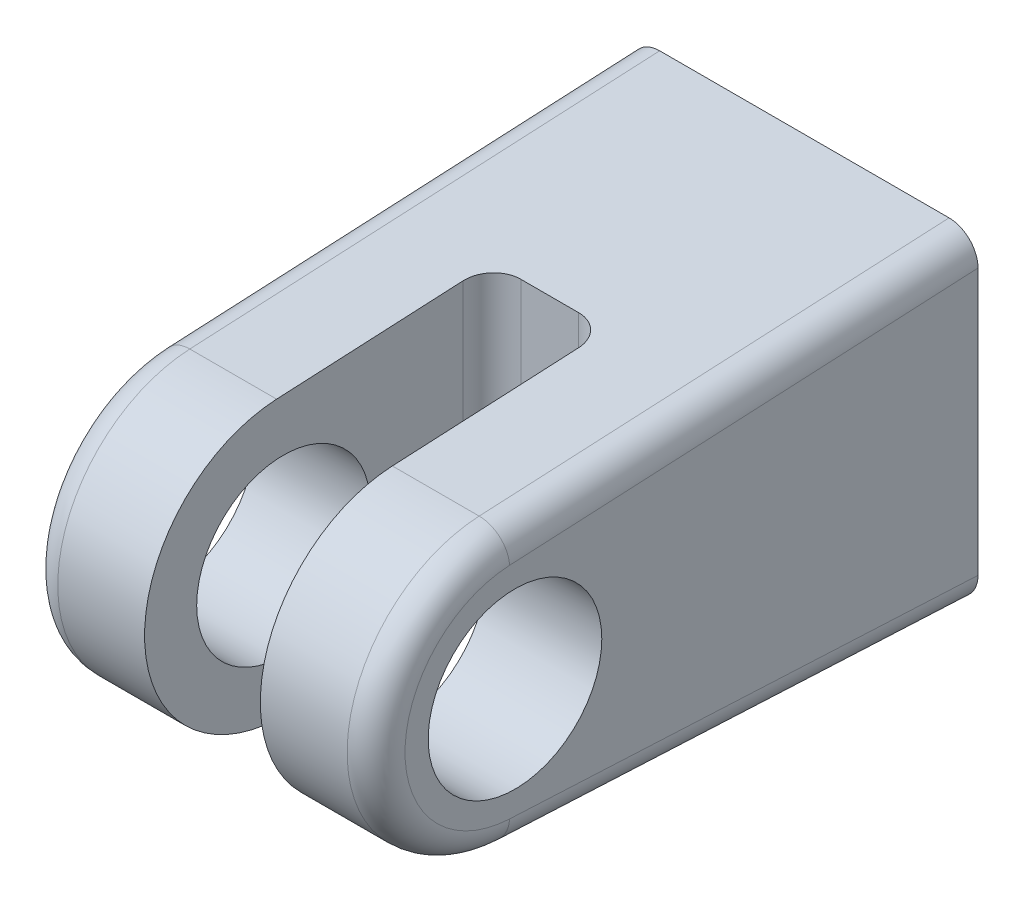
ISO-10303-21;
HEADER;
FILE_DESCRIPTION(('STEP AP214'),'2;1');
FILE_NAME('part.step','',(''),(''),'','','');
FILE_SCHEMA(('AUTOMOTIVE_DESIGN { 1 0 10303 214 1 1 1 1 }'));
ENDSEC;
DATA;
#1=APPLICATION_CONTEXT('core data for automotive mechanical design processes');
#2=APPLICATION_PROTOCOL_DEFINITION('international standard','automotive_design',2000,#1);
#3=PRODUCT_CONTEXT('',#1,'mechanical');
#4=PRODUCT('Part','Part','',(#3));
#5=PRODUCT_RELATED_PRODUCT_CATEGORY('part','',(#4));
#6=PRODUCT_DEFINITION_FORMATION('','',#4);
#7=PRODUCT_DEFINITION_CONTEXT('part definition',#1,'design');
#8=PRODUCT_DEFINITION('design','',#6,#7);
#9=PRODUCT_DEFINITION_SHAPE('','',#8);
#10=(LENGTH_UNIT() NAMED_UNIT(*) SI_UNIT(.MILLI.,.METRE.));
#11=(NAMED_UNIT(*) PLANE_ANGLE_UNIT() SI_UNIT($,.RADIAN.));
#12=(NAMED_UNIT(*) SI_UNIT($,.STERADIAN.) SOLID_ANGLE_UNIT());
#13=UNCERTAINTY_MEASURE_WITH_UNIT(LENGTH_MEASURE(1.E-05),#10,'distance_accuracy_value','');
#14=(GEOMETRIC_REPRESENTATION_CONTEXT(3) GLOBAL_UNCERTAINTY_ASSIGNED_CONTEXT((#13)) GLOBAL_UNIT_ASSIGNED_CONTEXT((#10,
#11,#12)) REPRESENTATION_CONTEXT('',''));
#15=CARTESIAN_POINT('',(0.,0.,0.));
#16=DIRECTION('',(0.,0.,1.));
#17=DIRECTION('',(1.,0.,0.));
#18=AXIS2_PLACEMENT_3D('',#15,#16,#17);
#19=CARTESIAN_POINT('',(9.525,0.,25.4));
#20=DIRECTION('',(-1.,0.,0.));
#21=DIRECTION('',(0.,0.,1.));
#22=AXIS2_PLACEMENT_3D('',#19,#20,#21);
#23=CYLINDRICAL_SURFACE('',#22,7.62);
#24=DIRECTION('',(-1.,0.,0.));
#25=VECTOR('',#24,1.);
#26=CARTESIAN_POINT('',(9.525,-7.61063246853942,25.7777213639888));
#27=LINE('',#26,#25);
#28=CARTESIAN_POINT('',(7.9375,-7.61063246853942,25.7777213639888));
#29=VERTEX_POINT('',#28);
#30=CARTESIAN_POINT('',(3.175,-7.61063246853942,25.7777213639888));
#31=VERTEX_POINT('',#30);
#32=EDGE_CURVE('E150',#29,#31,#27,.T.);
#33=ORIENTED_EDGE('',*,*,#32,.F.);
#34=CARTESIAN_POINT('',(7.9375,0.,25.4));
#35=DIRECTION('',(1.,0.,0.));
#36=DIRECTION('',(0.,0.,-1.));
#37=AXIS2_PLACEMENT_3D('',#34,#35,#36);
#38=CIRCLE('',#37,7.62);
#39=CARTESIAN_POINT('',(7.9375,7.61063246853942,25.7777213639888));
#40=VERTEX_POINT('',#39);
#41=EDGE_CURVE('E218',#29,#40,#38,.F.);
#42=ORIENTED_EDGE('',*,*,#41,.T.);
#43=DIRECTION('',(-1.,0.,0.));
#44=VECTOR('',#43,1.);
#45=CARTESIAN_POINT('',(9.525,7.61063246853942,25.7777213639888));
#46=LINE('',#45,#44);
#47=CARTESIAN_POINT('',(3.175,7.61063246853942,25.7777213639888));
#48=VERTEX_POINT('',#47);
#49=EDGE_CURVE('E169',#40,#48,#46,.T.);
#50=ORIENTED_EDGE('',*,*,#49,.T.);
#51=CARTESIAN_POINT('',(3.175,0.,25.4));
#52=DIRECTION('',(1.,0.,0.));
#53=DIRECTION('',(0.,0.,-1.));
#54=AXIS2_PLACEMENT_3D('',#51,#52,#53);
#55=CIRCLE('',#54,7.62);
#56=EDGE_CURVE('E167',#48,#31,#55,.T.);
#57=ORIENTED_EDGE('',*,*,#56,.T.);
#58=EDGE_LOOP('',(#33,#42,#50,#57));
#59=FACE_BOUND('',#58,.T.);
#60=ADVANCED_FACE('F49',(#59),#23,.T.);
#61=CARTESIAN_POINT('',(9.525,8.89,0.));
#62=DIRECTION('',(0.,0.,1.));
#63=DIRECTION('',(0.,-1.,0.));
#64=AXIS2_PLACEMENT_3D('',#61,#62,#63);
#65=PLANE('',#64);
#66=CARTESIAN_POINT('',(0.,0.,0.));
#67=DIRECTION('',(0.,0.,-1.));
#68=DIRECTION('',(0.,1.,0.));
#69=AXIS2_PLACEMENT_3D('',#66,#67,#68);
#70=CIRCLE('',#69,6.35);
#71=CARTESIAN_POINT('',(0.,6.35,0.));
#72=VERTEX_POINT('',#71);
#73=EDGE_CURVE('E242',#72,#72,#70,.T.);
#74=ORIENTED_EDGE('',*,*,#73,.F.);
#75=EDGE_LOOP('',(#74));
#76=FACE_BOUND('',#75,.T.);
#77=DIRECTION('',(-1.,0.,0.));
#78=VECTOR('',#77,1.);
#79=CARTESIAN_POINT('',(9.525,-8.89,0.));
#80=LINE('',#79,#78);
#81=CARTESIAN_POINT('',(7.9375,-8.89,0.));
#82=VERTEX_POINT('',#81);
#83=CARTESIAN_POINT('',(-7.93749999999999,-8.89,0.));
#84=VERTEX_POINT('',#83);
#85=EDGE_CURVE('E285',#82,#84,#80,.T.);
#86=ORIENTED_EDGE('',*,*,#85,.T.);
#87=CARTESIAN_POINT('',(-7.9375,-7.30054602886092,0.));
#88=DIRECTION('',(0.,0.,1.));
#89=DIRECTION('',(0.,-1.,0.));
#90=AXIS2_PLACEMENT_3D('',#87,#88,#89);
#91=ELLIPSE('',#90,1.58945397113908,1.5875);
#92=CARTESIAN_POINT('',(-9.525,-7.30054602886092,0.));
#93=VERTEX_POINT('',#92);
#94=EDGE_CURVE('E201',#84,#93,#91,.F.);
#95=ORIENTED_EDGE('',*,*,#94,.T.);
#96=DIRECTION('',(0.,1.,0.));
#97=VECTOR('',#96,1.);
#98=CARTESIAN_POINT('',(-9.525,8.89,0.));
#99=LINE('',#98,#97);
#100=CARTESIAN_POINT('',(-9.525,7.30054602886092,0.));
#101=VERTEX_POINT('',#100);
#102=EDGE_CURVE('E269',#93,#101,#99,.T.);
#103=ORIENTED_EDGE('',*,*,#102,.T.);
#104=CARTESIAN_POINT('',(-7.9375,7.30054602886092,0.));
#105=DIRECTION('',(0.,0.,1.));
#106=DIRECTION('',(0.,-1.,0.));
#107=AXIS2_PLACEMENT_3D('',#104,#105,#106);
#108=ELLIPSE('',#107,1.58945397113908,1.5875);
#109=CARTESIAN_POINT('',(-7.93749999999999,8.89,0.));
#110=VERTEX_POINT('',#109);
#111=EDGE_CURVE('E197',#101,#110,#108,.F.);
#112=ORIENTED_EDGE('',*,*,#111,.T.);
#113=DIRECTION('',(-1.,0.,0.));
#114=VECTOR('',#113,1.);
#115=CARTESIAN_POINT('',(9.525,8.89,0.));
#116=LINE('',#115,#114);
#117=CARTESIAN_POINT('',(7.9375,8.89,0.));
#118=VERTEX_POINT('',#117);
#119=EDGE_CURVE('E177',#118,#110,#116,.T.);
#120=ORIENTED_EDGE('',*,*,#119,.F.);
#121=CARTESIAN_POINT('',(7.9375,7.30054602886092,0.));
#122=DIRECTION('',(0.,0.,1.));
#123=DIRECTION('',(0.,1.,0.));
#124=AXIS2_PLACEMENT_3D('',#121,#122,#123);
#125=ELLIPSE('',#124,1.58945397113908,1.5875);
#126=CARTESIAN_POINT('',(9.525,7.30054602886092,0.));
#127=VERTEX_POINT('',#126);
#128=EDGE_CURVE('E195',#118,#127,#125,.F.);
#129=ORIENTED_EDGE('',*,*,#128,.T.);
#130=DIRECTION('',(0.,1.,0.));
#131=VECTOR('',#130,1.);
#132=CARTESIAN_POINT('',(9.525,8.89,0.));
#133=LINE('',#132,#131);
#134=CARTESIAN_POINT('',(9.525,-7.30054602886092,0.));
#135=VERTEX_POINT('',#134);
#136=EDGE_CURVE('E287',#135,#127,#133,.T.);
#137=ORIENTED_EDGE('',*,*,#136,.F.);
#138=CARTESIAN_POINT('',(7.9375,-7.30054602886092,0.));
#139=DIRECTION('',(0.,0.,1.));
#140=DIRECTION('',(0.,1.,0.));
#141=AXIS2_PLACEMENT_3D('',#138,#139,#140);
#142=ELLIPSE('',#141,1.58945397113908,1.5875);
#143=EDGE_CURVE('E199',#135,#82,#142,.F.);
#144=ORIENTED_EDGE('',*,*,#143,.T.);
#145=EDGE_LOOP('',(#86,#95,#103,#112,#120,#129,#137,#144));
#146=FACE_BOUND('',#145,.T.);
#147=ADVANCED_FACE('F263',(#76,#146),#65,.F.);
#148=CARTESIAN_POINT('',(9.525,8.89,0.));
#149=DIRECTION('',(0.,-0.998770665162654,-0.0495697328069288));
#150=DIRECTION('',(0.,0.0495697328069289,-0.998770665162654));
#151=AXIS2_PLACEMENT_3D('',#148,#149,#150);
#152=PLANE('',#151);
#153=ORIENTED_EDGE('',*,*,#119,.T.);
#154=DIRECTION('',(0.,-0.0495697328069289,0.998770665162654));
#155=VECTOR('',#154,1.);
#156=CARTESIAN_POINT('',(-7.9375,8.89,0.));
#157=LINE('',#156,#155);
#158=CARTESIAN_POINT('',(-7.93749999999999,7.61063246853942,25.7777213639888));
#159=VERTEX_POINT('',#158);
#160=EDGE_CURVE('E230',#110,#159,#157,.T.);
#161=ORIENTED_EDGE('',*,*,#160,.T.);
#162=CARTESIAN_POINT('',(-3.175,7.61063246853942,25.7777213639888));
#163=VERTEX_POINT('',#162);
#164=EDGE_CURVE('E162',#163,#159,#46,.T.);
#165=ORIENTED_EDGE('',*,*,#164,.F.);
#166=DIRECTION('',(0.,0.0495697328069289,-0.998770665162654));
#167=VECTOR('',#166,1.);
#168=CARTESIAN_POINT('',(-3.17500000000001,8.89,0.));
#169=LINE('',#168,#167);
#170=CARTESIAN_POINT('',(-3.175,8.11786967514889,15.5575));
#171=VERTEX_POINT('',#170);
#172=EDGE_CURVE('E289',#163,#171,#169,.T.);
#173=ORIENTED_EDGE('',*,*,#172,.T.);
#174=CARTESIAN_POINT('',(-1.5875,8.11786967514889,15.5575));
#175=DIRECTION('',(0.,-0.998770665162654,-0.0495697328069288));
#176=DIRECTION('',(0.,-0.0495697328069289,0.998770665162654));
#177=AXIS2_PLACEMENT_3D('',#174,#175,#176);
#178=ELLIPSE('',#177,1.58945397113908,1.5875);
#179=CARTESIAN_POINT('',(-1.5875,8.19665848380717,13.97));
#180=VERTEX_POINT('',#179);
#181=EDGE_CURVE('E232',#171,#180,#178,.T.);
#182=ORIENTED_EDGE('',*,*,#181,.T.);
#183=DIRECTION('',(1.,0.,0.));
#184=VECTOR('',#183,1.);
#185=CARTESIAN_POINT('',(9.525,8.19665848380717,13.97));
#186=LINE('',#185,#184);
#187=CARTESIAN_POINT('',(1.5875,8.19665848380717,13.97));
#188=VERTEX_POINT('',#187);
#189=EDGE_CURVE('E293',#180,#188,#186,.T.);
#190=ORIENTED_EDGE('',*,*,#189,.T.);
#191=CARTESIAN_POINT('',(1.5875,8.11786967514889,15.5575));
#192=DIRECTION('',(0.,-0.998770665162654,-0.0495697328069288));
#193=DIRECTION('',(0.,-0.0495697328069289,0.998770665162654));
#194=AXIS2_PLACEMENT_3D('',#191,#192,#193);
#195=ELLIPSE('',#194,1.58945397113908,1.5875);
#196=CARTESIAN_POINT('',(3.175,8.11786967514889,15.5575));
#197=VERTEX_POINT('',#196);
#198=EDGE_CURVE('E58',#188,#197,#195,.T.);
#199=ORIENTED_EDGE('',*,*,#198,.T.);
#200=DIRECTION('',(0.,-0.0495697328069289,0.998770665162654));
#201=VECTOR('',#200,1.);
#202=CARTESIAN_POINT('',(3.175,8.89,0.));
#203=LINE('',#202,#201);
#204=EDGE_CURVE('E171',#197,#48,#203,.T.);
#205=ORIENTED_EDGE('',*,*,#204,.T.);
#206=ORIENTED_EDGE('',*,*,#49,.F.);
#207=DIRECTION('',(0.,-0.0495697328069289,0.998770665162654));
#208=VECTOR('',#207,1.);
#209=CARTESIAN_POINT('',(7.9375,8.89,0.));
#210=LINE('',#209,#208);
#211=EDGE_CURVE('E228',#40,#118,#210,.F.);
#212=ORIENTED_EDGE('',*,*,#211,.T.);
#213=EDGE_LOOP('',(#153,#161,#165,#173,#182,#190,#199,#205,#206,#212));
#214=FACE_BOUND('',#213,.T.);
#215=ADVANCED_FACE('F259',(#214),#152,.F.);
#216=ORIENTED_EDGE('',*,*,#164,.T.);
#217=CARTESIAN_POINT('',(-7.9375,0.,25.4));
#218=DIRECTION('',(1.,0.,0.));
#219=DIRECTION('',(0.,0.,-1.));
#220=AXIS2_PLACEMENT_3D('',#217,#218,#219);
#221=CIRCLE('',#220,7.62);
#222=CARTESIAN_POINT('',(-7.93749999999999,-7.61063246853942,25.7777213639888));
#223=VERTEX_POINT('',#222);
#224=EDGE_CURVE('E209',#159,#223,#221,.T.);
#225=ORIENTED_EDGE('',*,*,#224,.T.);
#226=CARTESIAN_POINT('',(-3.175,-7.61063246853942,25.7777213639888));
#227=VERTEX_POINT('',#226);
#228=EDGE_CURVE('E163',#227,#223,#27,.T.);
#229=ORIENTED_EDGE('',*,*,#228,.F.);
#230=CARTESIAN_POINT('',(-3.175,0.,25.4));
#231=DIRECTION('',(-1.,0.,0.));
#232=DIRECTION('',(0.,0.,1.));
#233=AXIS2_PLACEMENT_3D('',#230,#231,#232);
#234=CIRCLE('',#233,7.62);
#235=EDGE_CURVE('E283',#227,#163,#234,.T.);
#236=ORIENTED_EDGE('',*,*,#235,.T.);
#237=EDGE_LOOP('',(#216,#225,#229,#236));
#238=FACE_BOUND('',#237,.T.);
#239=ADVANCED_FACE('F280',(#238),#23,.T.);
#240=CARTESIAN_POINT('',(9.525,-8.89,0.));
#241=DIRECTION('',(0.,0.998770665162654,-0.0495697328069286));
#242=DIRECTION('',(0.,0.0495697328069286,0.998770665162654));
#243=AXIS2_PLACEMENT_3D('',#240,#241,#242);
#244=PLANE('',#243);
#245=ORIENTED_EDGE('',*,*,#228,.T.);
#246=DIRECTION('',(0.,-0.0495697328069286,-0.998770665162654));
#247=VECTOR('',#246,1.);
#248=CARTESIAN_POINT('',(-7.9375,-8.89,0.));
#249=LINE('',#248,#247);
#250=EDGE_CURVE('E192',#223,#84,#249,.T.);
#251=ORIENTED_EDGE('',*,*,#250,.T.);
#252=ORIENTED_EDGE('',*,*,#85,.F.);
#253=DIRECTION('',(0.,-0.0495697328069286,-0.998770665162654));
#254=VECTOR('',#253,1.);
#255=CARTESIAN_POINT('',(7.9375,-7.61063246853942,25.7777213639888));
#256=LINE('',#255,#254);
#257=EDGE_CURVE('E159',#82,#29,#256,.F.);
#258=ORIENTED_EDGE('',*,*,#257,.T.);
#259=ORIENTED_EDGE('',*,*,#32,.T.);
#260=DIRECTION('',(0.,-0.0495697328069286,-0.998770665162654));
#261=VECTOR('',#260,1.);
#262=CARTESIAN_POINT('',(3.175,-8.89,0.));
#263=LINE('',#262,#261);
#264=CARTESIAN_POINT('',(3.175,-8.1178696751489,15.5575));
#265=VERTEX_POINT('',#264);
#266=EDGE_CURVE('E155',#31,#265,#263,.T.);
#267=ORIENTED_EDGE('',*,*,#266,.T.);
#268=CARTESIAN_POINT('',(1.5875,-8.1178696751489,15.5575));
#269=DIRECTION('',(0.,0.998770665162654,-0.0495697328069286));
#270=DIRECTION('',(0.,-0.0495697328069286,-0.998770665162654));
#271=AXIS2_PLACEMENT_3D('',#268,#269,#270);
#272=ELLIPSE('',#271,1.58945397113908,1.5875);
#273=CARTESIAN_POINT('',(1.5875,-8.19665848380717,13.97));
#274=VERTEX_POINT('',#273);
#275=EDGE_CURVE('E13',#265,#274,#272,.T.);
#276=ORIENTED_EDGE('',*,*,#275,.T.);
#277=DIRECTION('',(-1.,0.,0.));
#278=VECTOR('',#277,1.);
#279=CARTESIAN_POINT('',(9.525,-8.19665848380717,13.97));
#280=LINE('',#279,#278);
#281=CARTESIAN_POINT('',(-1.5875,-8.19665848380717,13.97));
#282=VERTEX_POINT('',#281);
#283=EDGE_CURVE('E176',#274,#282,#280,.T.);
#284=ORIENTED_EDGE('',*,*,#283,.T.);
#285=CARTESIAN_POINT('',(-1.5875,-8.1178696751489,15.5575));
#286=DIRECTION('',(0.,0.998770665162654,-0.0495697328069286));
#287=DIRECTION('',(0.,-0.0495697328069286,-0.998770665162654));
#288=AXIS2_PLACEMENT_3D('',#285,#286,#287);
#289=ELLIPSE('',#288,1.58945397113908,1.5875);
#290=CARTESIAN_POINT('',(-3.175,-8.1178696751489,15.5575));
#291=VERTEX_POINT('',#290);
#292=EDGE_CURVE('E234',#282,#291,#289,.T.);
#293=ORIENTED_EDGE('',*,*,#292,.T.);
#294=DIRECTION('',(0.,0.0495697328069286,0.998770665162654));
#295=VECTOR('',#294,1.);
#296=CARTESIAN_POINT('',(-3.17500000000001,-8.89,0.));
#297=LINE('',#296,#295);
#298=EDGE_CURVE('E180',#291,#227,#297,.T.);
#299=ORIENTED_EDGE('',*,*,#298,.T.);
#300=EDGE_LOOP('',(#245,#251,#252,#258,#259,#267,#276,#284,#293,#299));
#301=FACE_BOUND('',#300,.T.);
#302=ADVANCED_FACE('F153',(#301),#244,.F.);
#303=CARTESIAN_POINT('',(9.525,0.,25.4));
#304=DIRECTION('',(1.,0.,0.));
#305=DIRECTION('',(0.,0.,-1.));
#306=AXIS2_PLACEMENT_3D('',#303,#304,#305);
#307=PLANE('',#306);
#308=CARTESIAN_POINT('',(9.525,0.,25.4));
#309=DIRECTION('',(1.,0.,0.));
#310=DIRECTION('',(0.,0.,-1.));
#311=AXIS2_PLACEMENT_3D('',#308,#309,#310);
#312=CIRCLE('',#311,4.7625);
#313=CARTESIAN_POINT('',(9.525,0.,20.6375));
#314=VERTEX_POINT('',#313);
#315=EDGE_CURVE('E298',#314,#314,#312,.T.);
#316=ORIENTED_EDGE('',*,*,#315,.F.);
#317=EDGE_LOOP('',(#316));
#318=FACE_BOUND('',#317,.T.);
#319=CARTESIAN_POINT('',(9.525,0.,25.4));
#320=DIRECTION('',(1.,0.,0.));
#321=DIRECTION('',(0.,0.,-1.));
#322=AXIS2_PLACEMENT_3D('',#319,#320,#321);
#323=CIRCLE('',#322,6.0325);
#324=CARTESIAN_POINT('',(9.525,6.0250840375937,25.6990294131578));
#325=VERTEX_POINT('',#324);
#326=CARTESIAN_POINT('',(9.525,-6.02508403759371,25.6990294131578));
#327=VERTEX_POINT('',#326);
#328=EDGE_CURVE('E213',#325,#327,#323,.T.);
#329=ORIENTED_EDGE('',*,*,#328,.T.);
#330=DIRECTION('',(0.,-0.0495697328069286,-0.998770665162654));
#331=VECTOR('',#330,1.);
#332=CARTESIAN_POINT('',(9.525,-7.30445156905429,-0.0786919508310134));
#333=LINE('',#332,#331);
#334=EDGE_CURVE('E215',#327,#135,#333,.T.);
#335=ORIENTED_EDGE('',*,*,#334,.T.);
#336=ORIENTED_EDGE('',*,*,#136,.T.);
#337=DIRECTION('',(0.,-0.0495697328069289,0.998770665162654));
#338=VECTOR('',#337,1.);
#339=CARTESIAN_POINT('',(9.525,6.0250840375937,25.6990294131578));
#340=LINE('',#339,#338);
#341=EDGE_CURVE('E211',#127,#325,#340,.T.);
#342=ORIENTED_EDGE('',*,*,#341,.T.);
#343=EDGE_LOOP('',(#329,#335,#336,#342));
#344=FACE_BOUND('',#343,.T.);
#345=ADVANCED_FACE('F363',(#318,#344),#307,.T.);
#346=CARTESIAN_POINT('',(-9.525,0.,25.4));
#347=DIRECTION('',(1.,0.,0.));
#348=DIRECTION('',(0.,0.,-1.));
#349=AXIS2_PLACEMENT_3D('',#346,#347,#348);
#350=PLANE('',#349);
#351=CARTESIAN_POINT('',(-9.525,0.,25.4));
#352=DIRECTION('',(1.,0.,0.));
#353=DIRECTION('',(0.,0.,-1.));
#354=AXIS2_PLACEMENT_3D('',#351,#352,#353);
#355=CIRCLE('',#354,4.7625);
#356=CARTESIAN_POINT('',(-9.525,0.,20.6375));
#357=VERTEX_POINT('',#356);
#358=EDGE_CURVE('E190',#357,#357,#355,.T.);
#359=ORIENTED_EDGE('',*,*,#358,.T.);
#360=EDGE_LOOP('',(#359));
#361=FACE_BOUND('',#360,.T.);
#362=ORIENTED_EDGE('',*,*,#102,.F.);
#363=DIRECTION('',(0.,-0.0495697328069286,-0.998770665162654));
#364=VECTOR('',#363,1.);
#365=CARTESIAN_POINT('',(-9.525,-6.02508403759371,25.6990294131578));
#366=LINE('',#365,#364);
#367=CARTESIAN_POINT('',(-9.525,-6.02508403759371,25.6990294131578));
#368=VERTEX_POINT('',#367);
#369=EDGE_CURVE('E207',#93,#368,#366,.F.);
#370=ORIENTED_EDGE('',*,*,#369,.T.);
#371=CARTESIAN_POINT('',(-9.525,0.,25.4));
#372=DIRECTION('',(1.,0.,0.));
#373=DIRECTION('',(0.,0.,-1.));
#374=AXIS2_PLACEMENT_3D('',#371,#372,#373);
#375=CIRCLE('',#374,6.0325);
#376=CARTESIAN_POINT('',(-9.525,6.02508403759371,25.6990294131578));
#377=VERTEX_POINT('',#376);
#378=EDGE_CURVE('E205',#368,#377,#375,.F.);
#379=ORIENTED_EDGE('',*,*,#378,.T.);
#380=DIRECTION('',(0.,-0.0495697328069289,0.998770665162654));
#381=VECTOR('',#380,1.);
#382=CARTESIAN_POINT('',(-9.525,6.0250840375937,25.6990294131578));
#383=LINE('',#382,#381);
#384=EDGE_CURVE('E203',#377,#101,#383,.F.);
#385=ORIENTED_EDGE('',*,*,#384,.T.);
#386=EDGE_LOOP('',(#362,#370,#379,#385));
#387=FACE_BOUND('',#386,.T.);
#388=ADVANCED_FACE('F361',(#361,#387),#350,.F.);
#389=CARTESIAN_POINT('',(-3.175,-8.89,13.97));
#390=DIRECTION('',(-1.,0.,0.));
#391=DIRECTION('',(0.,0.,1.));
#392=AXIS2_PLACEMENT_3D('',#389,#390,#391);
#393=PLANE('',#392);
#394=CARTESIAN_POINT('',(-3.175,0.,25.4));
#395=DIRECTION('',(-1.,0.,0.));
#396=DIRECTION('',(0.,0.,1.));
#397=AXIS2_PLACEMENT_3D('',#394,#395,#396);
#398=CIRCLE('',#397,4.7625);
#399=CARTESIAN_POINT('',(-3.175,0.,30.1625));
#400=VERTEX_POINT('',#399);
#401=EDGE_CURVE('E172',#400,#400,#398,.T.);
#402=ORIENTED_EDGE('',*,*,#401,.T.);
#403=EDGE_LOOP('',(#402));
#404=FACE_BOUND('',#403,.T.);
#405=ORIENTED_EDGE('',*,*,#298,.F.);
#406=DIRECTION('',(0.,1.,0.));
#407=VECTOR('',#406,1.);
#408=CARTESIAN_POINT('',(-3.175,8.19665848380717,15.5575));
#409=LINE('',#408,#407);
#410=EDGE_CURVE('E220',#291,#171,#409,.T.);
#411=ORIENTED_EDGE('',*,*,#410,.T.);
#412=ORIENTED_EDGE('',*,*,#172,.F.);
#413=ORIENTED_EDGE('',*,*,#235,.F.);
#414=EDGE_LOOP('',(#405,#411,#412,#413));
#415=FACE_BOUND('',#414,.T.);
#416=ADVANCED_FACE('F355',(#404,#415),#393,.F.);
#417=CARTESIAN_POINT('',(-3.175,-8.89,13.97));
#418=DIRECTION('',(0.,0.,-1.));
#419=DIRECTION('',(-1.,0.,0.));
#420=AXIS2_PLACEMENT_3D('',#417,#418,#419);
#421=PLANE('',#420);
#422=ORIENTED_EDGE('',*,*,#189,.F.);
#423=DIRECTION('',(0.,1.,0.));
#424=VECTOR('',#423,1.);
#425=CARTESIAN_POINT('',(-1.5875,-8.19665848380717,13.97));
#426=LINE('',#425,#424);
#427=EDGE_CURVE('E225',#180,#282,#426,.F.);
#428=ORIENTED_EDGE('',*,*,#427,.T.);
#429=ORIENTED_EDGE('',*,*,#283,.F.);
#430=DIRECTION('',(0.,1.,0.));
#431=VECTOR('',#430,1.);
#432=CARTESIAN_POINT('',(1.5875,8.19665848380717,13.97));
#433=LINE('',#432,#431);
#434=EDGE_CURVE('E223',#274,#188,#433,.T.);
#435=ORIENTED_EDGE('',*,*,#434,.T.);
#436=EDGE_LOOP('',(#422,#428,#429,#435));
#437=FACE_BOUND('',#436,.T.);
#438=ADVANCED_FACE('F370',(#437),#421,.F.);
#439=CARTESIAN_POINT('',(3.175,-8.89,13.97));
#440=DIRECTION('',(1.,0.,0.));
#441=DIRECTION('',(0.,0.,-1.));
#442=AXIS2_PLACEMENT_3D('',#439,#440,#441);
#443=PLANE('',#442);
#444=CARTESIAN_POINT('',(3.175,0.,25.4));
#445=DIRECTION('',(1.,0.,0.));
#446=DIRECTION('',(0.,0.,-1.));
#447=AXIS2_PLACEMENT_3D('',#444,#445,#446);
#448=CIRCLE('',#447,4.7625);
#449=CARTESIAN_POINT('',(3.175,0.,20.6375));
#450=VERTEX_POINT('',#449);
#451=EDGE_CURVE('E187',#450,#450,#448,.T.);
#452=ORIENTED_EDGE('',*,*,#451,.T.);
#453=EDGE_LOOP('',(#452));
#454=FACE_BOUND('',#453,.T.);
#455=ORIENTED_EDGE('',*,*,#204,.F.);
#456=DIRECTION('',(0.,1.,0.));
#457=VECTOR('',#456,1.);
#458=CARTESIAN_POINT('',(3.175,-8.19665848380717,15.5575));
#459=LINE('',#458,#457);
#460=EDGE_CURVE('E175',#197,#265,#459,.F.);
#461=ORIENTED_EDGE('',*,*,#460,.T.);
#462=ORIENTED_EDGE('',*,*,#266,.F.);
#463=ORIENTED_EDGE('',*,*,#56,.F.);
#464=EDGE_LOOP('',(#455,#461,#462,#463));
#465=FACE_BOUND('',#464,.T.);
#466=ADVANCED_FACE('F174',(#454,#465),#443,.F.);
#467=CARTESIAN_POINT('',(-9.525,0.,25.4));
#468=DIRECTION('',(1.,0.,0.));
#469=DIRECTION('',(0.,0.,-1.));
#470=AXIS2_PLACEMENT_3D('',#467,#468,#469);
#471=CYLINDRICAL_SURFACE('',#470,4.7625);
#472=ORIENTED_EDGE('',*,*,#315,.T.);
#473=EDGE_LOOP('',(#472));
#474=FACE_BOUND('',#473,.T.);
#475=ORIENTED_EDGE('',*,*,#451,.F.);
#476=EDGE_LOOP('',(#475));
#477=FACE_BOUND('',#476,.T.);
#478=ADVANCED_FACE('F419',(#474,#477),#471,.F.);
#479=ORIENTED_EDGE('',*,*,#358,.F.);
#480=EDGE_LOOP('',(#479));
#481=FACE_BOUND('',#480,.T.);
#482=ORIENTED_EDGE('',*,*,#401,.F.);
#483=EDGE_LOOP('',(#482));
#484=FACE_BOUND('',#483,.T.);
#485=ADVANCED_FACE('F314',(#481,#484),#471,.F.);
#486=CARTESIAN_POINT('',(0.,0.,9.525));
#487=DIRECTION('',(0.,0.,-1.));
#488=DIRECTION('',(0.,1.,0.));
#489=AXIS2_PLACEMENT_3D('',#486,#487,#488);
#490=CYLINDRICAL_SURFACE('',#489,6.35);
#491=CARTESIAN_POINT('',(0.,0.,9.525));
#492=DIRECTION('',(0.,0.,-1.));
#493=DIRECTION('',(0.,1.,0.));
#494=AXIS2_PLACEMENT_3D('',#491,#492,#493);
#495=CIRCLE('',#494,6.35);
#496=CARTESIAN_POINT('',(0.,6.35,9.525));
#497=VERTEX_POINT('',#496);
#498=EDGE_CURVE('E301',#497,#497,#495,.T.);
#499=ORIENTED_EDGE('',*,*,#498,.F.);
#500=EDGE_LOOP('',(#499));
#501=FACE_BOUND('',#500,.T.);
#502=ORIENTED_EDGE('',*,*,#73,.T.);
#503=EDGE_LOOP('',(#502));
#504=FACE_BOUND('',#503,.T.);
#505=ADVANCED_FACE('F311',(#501,#504),#490,.F.);
#506=CARTESIAN_POINT('',(0.,0.,9.525));
#507=DIRECTION('',(0.,0.,-1.));
#508=DIRECTION('',(0.,1.,0.));
#509=AXIS2_PLACEMENT_3D('',#506,#507,#508);
#510=PLANE('',#509);
#511=ORIENTED_EDGE('',*,*,#498,.T.);
#512=EDGE_LOOP('',(#511));
#513=FACE_BOUND('',#512,.T.);
#514=ADVANCED_FACE('F309',(#513),#510,.T.);
#515=CARTESIAN_POINT('',(-7.9375,7.30445156905429,-0.0786919508309994));
#516=DIRECTION('',(0.,-0.0495697328069289,0.998770665162654));
#517=DIRECTION('',(0.,-0.998770665162654,-0.0495697328069288));
#518=AXIS2_PLACEMENT_3D('',#515,#516,#517);
#519=CYLINDRICAL_SURFACE('',#518,1.5875);
#520=ORIENTED_EDGE('',*,*,#111,.F.);
#521=ORIENTED_EDGE('',*,*,#384,.F.);
#522=CARTESIAN_POINT('',(-7.9375,6.0250840375937,25.6990294131578));
#523=DIRECTION('',(0.,-0.0495697328069288,0.998770665162654));
#524=DIRECTION('',(0.,-0.998770665162654,-0.0495697328069288));
#525=AXIS2_PLACEMENT_3D('',#522,#523,#524);
#526=CIRCLE('',#525,1.5875);
#527=EDGE_CURVE('E240',#159,#377,#526,.T.);
#528=ORIENTED_EDGE('',*,*,#527,.F.);
#529=ORIENTED_EDGE('',*,*,#160,.F.);
#530=EDGE_LOOP('',(#520,#521,#528,#529));
#531=FACE_BOUND('',#530,.T.);
#532=ADVANCED_FACE('F272',(#531),#519,.T.);
#533=CARTESIAN_POINT('',(-7.9375,0.,25.4));
#534=DIRECTION('',(1.,0.,0.));
#535=DIRECTION('',(0.,0.,-1.));
#536=AXIS2_PLACEMENT_3D('',#533,#534,#535);
#537=TOROIDAL_SURFACE('',#536,6.0325,1.5875);
#538=ORIENTED_EDGE('',*,*,#527,.T.);
#539=ORIENTED_EDGE('',*,*,#378,.F.);
#540=CARTESIAN_POINT('',(-7.9375,-6.02508403759371,25.6990294131578));
#541=DIRECTION('',(0.,-0.0495697328069288,-0.998770665162654));
#542=DIRECTION('',(0.,0.998770665162654,-0.0495697328069288));
#543=AXIS2_PLACEMENT_3D('',#540,#541,#542);
#544=CIRCLE('',#543,1.5875);
#545=EDGE_CURVE('E237',#223,#368,#544,.T.);
#546=ORIENTED_EDGE('',*,*,#545,.F.);
#547=ORIENTED_EDGE('',*,*,#224,.F.);
#548=EDGE_LOOP('',(#538,#539,#546,#547));
#549=FACE_BOUND('',#548,.T.);
#550=ADVANCED_FACE('F330',(#549),#537,.T.);
#551=CARTESIAN_POINT('',(-7.9375,-7.30445156905429,-0.0786919508310012));
#552=DIRECTION('',(0.,-0.0495697328069286,-0.998770665162654));
#553=DIRECTION('',(0.,0.998770665162654,-0.0495697328069286));
#554=AXIS2_PLACEMENT_3D('',#551,#552,#553);
#555=CYLINDRICAL_SURFACE('',#554,1.5875);
#556=ORIENTED_EDGE('',*,*,#545,.T.);
#557=ORIENTED_EDGE('',*,*,#369,.F.);
#558=ORIENTED_EDGE('',*,*,#94,.F.);
#559=ORIENTED_EDGE('',*,*,#250,.F.);
#560=EDGE_LOOP('',(#556,#557,#558,#559));
#561=FACE_BOUND('',#560,.T.);
#562=ADVANCED_FACE('F327',(#561),#555,.T.);
#563=CARTESIAN_POINT('',(7.9375,6.0250840375937,25.6990294131578));
#564=DIRECTION('',(0.,0.0495697328069289,-0.998770665162654));
#565=DIRECTION('',(0.,0.998770665162654,0.0495697328069288));
#566=AXIS2_PLACEMENT_3D('',#563,#564,#565);
#567=CYLINDRICAL_SURFACE('',#566,1.5875);
#568=ORIENTED_EDGE('',*,*,#128,.F.);
#569=ORIENTED_EDGE('',*,*,#211,.F.);
#570=CARTESIAN_POINT('',(7.9375,6.0250840375937,25.6990294131578));
#571=DIRECTION('',(0.,-0.0495697328069288,0.998770665162654));
#572=DIRECTION('',(0.,-0.998770665162654,-0.0495697328069288));
#573=AXIS2_PLACEMENT_3D('',#570,#571,#572);
#574=CIRCLE('',#573,1.5875);
#575=EDGE_CURVE('E53',#325,#40,#574,.T.);
#576=ORIENTED_EDGE('',*,*,#575,.F.);
#577=ORIENTED_EDGE('',*,*,#341,.F.);
#578=EDGE_LOOP('',(#568,#569,#576,#577));
#579=FACE_BOUND('',#578,.T.);
#580=ADVANCED_FACE('F257',(#579),#567,.T.);
#581=CARTESIAN_POINT('',(7.9375,0.,25.4));
#582=DIRECTION('',(1.,0.,0.));
#583=DIRECTION('',(0.,0.,-1.));
#584=AXIS2_PLACEMENT_3D('',#581,#582,#583);
#585=TOROIDAL_SURFACE('',#584,6.0325,1.5875);
#586=ORIENTED_EDGE('',*,*,#575,.T.);
#587=ORIENTED_EDGE('',*,*,#41,.F.);
#588=CARTESIAN_POINT('',(7.9375,-6.02508403759371,25.6990294131578));
#589=DIRECTION('',(0.,-0.0495697328069288,-0.998770665162654));
#590=DIRECTION('',(0.,0.998770665162654,-0.0495697328069288));
#591=AXIS2_PLACEMENT_3D('',#588,#589,#590);
#592=CIRCLE('',#591,1.5875);
#593=EDGE_CURVE('E243',#327,#29,#592,.T.);
#594=ORIENTED_EDGE('',*,*,#593,.F.);
#595=ORIENTED_EDGE('',*,*,#328,.F.);
#596=EDGE_LOOP('',(#586,#587,#594,#595));
#597=FACE_BOUND('',#596,.T.);
#598=ADVANCED_FACE('F252',(#597),#585,.T.);
#599=CARTESIAN_POINT('',(7.9375,-6.02508403759371,25.6990294131578));
#600=DIRECTION('',(0.,0.0495697328069286,0.998770665162654));
#601=DIRECTION('',(0.,-0.998770665162654,0.0495697328069286));
#602=AXIS2_PLACEMENT_3D('',#599,#600,#601);
#603=CYLINDRICAL_SURFACE('',#602,1.5875);
#604=ORIENTED_EDGE('',*,*,#593,.T.);
#605=ORIENTED_EDGE('',*,*,#257,.F.);
#606=ORIENTED_EDGE('',*,*,#143,.F.);
#607=ORIENTED_EDGE('',*,*,#334,.F.);
#608=EDGE_LOOP('',(#604,#605,#606,#607));
#609=FACE_BOUND('',#608,.T.);
#610=ADVANCED_FACE('F337',(#609),#603,.T.);
#611=CARTESIAN_POINT('',(-1.5875,-8.89,15.5575));
#612=DIRECTION('',(0.,-1.,0.));
#613=DIRECTION('',(0.,0.,-1.));
#614=AXIS2_PLACEMENT_3D('',#611,#612,#613);
#615=CYLINDRICAL_SURFACE('',#614,1.5875);
#616=ORIENTED_EDGE('',*,*,#292,.F.);
#617=ORIENTED_EDGE('',*,*,#427,.F.);
#618=ORIENTED_EDGE('',*,*,#181,.F.);
#619=ORIENTED_EDGE('',*,*,#410,.F.);
#620=EDGE_LOOP('',(#616,#617,#618,#619));
#621=FACE_BOUND('',#620,.T.);
#622=ADVANCED_FACE('F340',(#621),#615,.F.);
#623=CARTESIAN_POINT('',(1.5875,-8.89,15.5575));
#624=DIRECTION('',(0.,-1.,0.));
#625=DIRECTION('',(0.,0.,-1.));
#626=AXIS2_PLACEMENT_3D('',#623,#624,#625);
#627=CYLINDRICAL_SURFACE('',#626,1.5875);
#628=ORIENTED_EDGE('',*,*,#275,.F.);
#629=ORIENTED_EDGE('',*,*,#460,.F.);
#630=ORIENTED_EDGE('',*,*,#198,.F.);
#631=ORIENTED_EDGE('',*,*,#434,.F.);
#632=EDGE_LOOP('',(#628,#629,#630,#631));
#633=FACE_BOUND('',#632,.T.);
#634=ADVANCED_FACE('F51',(#633),#627,.F.);
#635=CLOSED_SHELL('',(#60,#147,#215,#239,#302,#345,#388,#416,#438,#466,#478,#485,#505,#514,#532,
#550,#562,#580,#598,#610,#622,#634));
#636=MANIFOLD_SOLID_BREP('B2',#635);
#637=ADVANCED_BREP_SHAPE_REPRESENTATION('',(#18,#636),#14);
#638=SHAPE_DEFINITION_REPRESENTATION(#9,#637);
ENDSEC;
END-ISO-10303-21;
